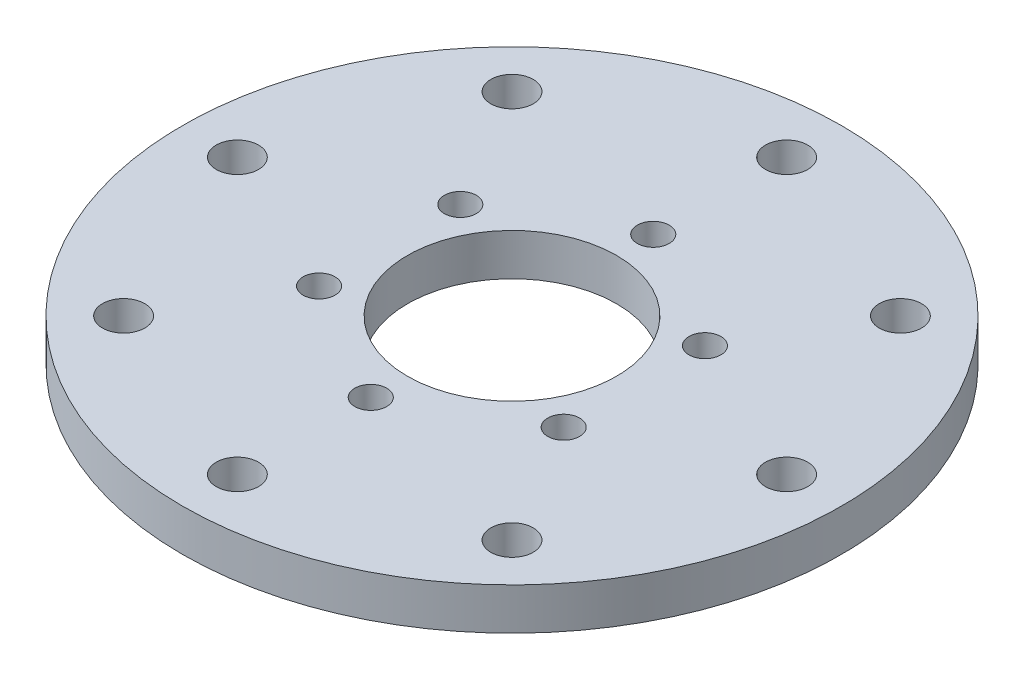
ISO-10303-21;
HEADER;
FILE_DESCRIPTION(('STEP AP214'),'2;1');
FILE_NAME('part.step','',(''),(''),'','','');
FILE_SCHEMA(('AUTOMOTIVE_DESIGN { 1 0 10303 214 1 1 1 1 }'));
ENDSEC;
DATA;
#1=APPLICATION_CONTEXT('core data for automotive mechanical design processes');
#2=APPLICATION_PROTOCOL_DEFINITION('international standard','automotive_design',2000,#1);
#3=PRODUCT_CONTEXT('',#1,'mechanical');
#4=PRODUCT('Part','Part','',(#3));
#5=PRODUCT_RELATED_PRODUCT_CATEGORY('part','',(#4));
#6=PRODUCT_DEFINITION_FORMATION('','',#4);
#7=PRODUCT_DEFINITION_CONTEXT('part definition',#1,'design');
#8=PRODUCT_DEFINITION('design','',#6,#7);
#9=PRODUCT_DEFINITION_SHAPE('','',#8);
#10=(LENGTH_UNIT() NAMED_UNIT(*) SI_UNIT(.MILLI.,.METRE.));
#11=(NAMED_UNIT(*) PLANE_ANGLE_UNIT() SI_UNIT($,.RADIAN.));
#12=(NAMED_UNIT(*) SI_UNIT($,.STERADIAN.) SOLID_ANGLE_UNIT());
#13=UNCERTAINTY_MEASURE_WITH_UNIT(LENGTH_MEASURE(1.E-05),#10,'distance_accuracy_value','');
#14=(GEOMETRIC_REPRESENTATION_CONTEXT(3) GLOBAL_UNCERTAINTY_ASSIGNED_CONTEXT((#13)) GLOBAL_UNIT_ASSIGNED_CONTEXT((#10,
#11,#12)) REPRESENTATION_CONTEXT('',''));
#15=CARTESIAN_POINT('',(0.,0.,0.));
#16=DIRECTION('',(0.,0.,1.));
#17=DIRECTION('',(1.,0.,0.));
#18=AXIS2_PLACEMENT_3D('',#15,#16,#17);
#19=CARTESIAN_POINT('',(0.,4.,0.));
#20=DIRECTION('',(0.,1.,0.));
#21=DIRECTION('',(0.,0.,1.));
#22=AXIS2_PLACEMENT_3D('',#19,#20,#21);
#23=PLANE('',#22);
#24=CARTESIAN_POINT('',(0.,4.,0.));
#25=DIRECTION('',(0.,1.,0.));
#26=DIRECTION('',(0.,0.,1.));
#27=AXIS2_PLACEMENT_3D('',#24,#25,#26);
#28=CIRCLE('',#27,10.);
#29=CARTESIAN_POINT('',(0.,4.,10.));
#30=VERTEX_POINT('',#29);
#31=EDGE_CURVE('E131',#30,#30,#28,.F.);
#32=ORIENTED_EDGE('',*,*,#31,.T.);
#33=EDGE_LOOP('',(#32));
#34=FACE_BOUND('',#33,.T.);
#35=CARTESIAN_POINT('',(0.,4.,13.5));
#36=DIRECTION('',(0.,1.,0.));
#37=DIRECTION('',(0.,0.,1.));
#38=AXIS2_PLACEMENT_3D('',#35,#36,#37);
#39=CIRCLE('',#38,1.525);
#40=CARTESIAN_POINT('',(0.,4.,15.025));
#41=VERTEX_POINT('',#40);
#42=EDGE_CURVE('E80',#41,#41,#39,.F.);
#43=ORIENTED_EDGE('',*,*,#42,.T.);
#44=EDGE_LOOP('',(#43));
#45=FACE_BOUND('',#44,.T.);
#46=CARTESIAN_POINT('',(-11.6913429510899,4.,6.75));
#47=DIRECTION('',(0.,1.,0.));
#48=DIRECTION('',(0.,0.,1.));
#49=AXIS2_PLACEMENT_3D('',#46,#47,#48);
#50=CIRCLE('',#49,1.525);
#51=CARTESIAN_POINT('',(-11.6913429510899,4.,8.275));
#52=VERTEX_POINT('',#51);
#53=EDGE_CURVE('E107',#52,#52,#50,.F.);
#54=ORIENTED_EDGE('',*,*,#53,.T.);
#55=EDGE_LOOP('',(#54));
#56=FACE_BOUND('',#55,.T.);
#57=CARTESIAN_POINT('',(-11.6913429510899,4.,-6.75000000000001));
#58=DIRECTION('',(0.,1.,0.));
#59=DIRECTION('',(0.,0.,1.));
#60=AXIS2_PLACEMENT_3D('',#57,#58,#59);
#61=CIRCLE('',#60,1.525);
#62=CARTESIAN_POINT('',(-11.6913429510899,4.,-5.225));
#63=VERTEX_POINT('',#62);
#64=EDGE_CURVE('E100',#63,#63,#61,.F.);
#65=ORIENTED_EDGE('',*,*,#64,.T.);
#66=EDGE_LOOP('',(#65));
#67=FACE_BOUND('',#66,.T.);
#68=CARTESIAN_POINT('',(0.,4.,-13.5));
#69=DIRECTION('',(0.,1.,0.));
#70=DIRECTION('',(0.,0.,1.));
#71=AXIS2_PLACEMENT_3D('',#68,#69,#70);
#72=CIRCLE('',#71,1.525);
#73=CARTESIAN_POINT('',(0.,4.,-11.975));
#74=VERTEX_POINT('',#73);
#75=EDGE_CURVE('E108',#74,#74,#72,.F.);
#76=ORIENTED_EDGE('',*,*,#75,.T.);
#77=EDGE_LOOP('',(#76));
#78=FACE_BOUND('',#77,.T.);
#79=CARTESIAN_POINT('',(11.6913429510899,4.,-6.75));
#80=DIRECTION('',(0.,1.,0.));
#81=DIRECTION('',(0.,0.,1.));
#82=AXIS2_PLACEMENT_3D('',#79,#80,#81);
#83=CIRCLE('',#82,1.525);
#84=CARTESIAN_POINT('',(11.6913429510899,4.,-5.225));
#85=VERTEX_POINT('',#84);
#86=EDGE_CURVE('E114',#85,#85,#83,.F.);
#87=ORIENTED_EDGE('',*,*,#86,.T.);
#88=EDGE_LOOP('',(#87));
#89=FACE_BOUND('',#88,.T.);
#90=CARTESIAN_POINT('',(11.6913429510899,4.,6.75));
#91=DIRECTION('',(0.,1.,0.));
#92=DIRECTION('',(0.,0.,1.));
#93=AXIS2_PLACEMENT_3D('',#90,#91,#92);
#94=CIRCLE('',#93,1.525);
#95=CARTESIAN_POINT('',(11.6913429510899,4.,8.275));
#96=VERTEX_POINT('',#95);
#97=EDGE_CURVE('E120',#96,#96,#94,.F.);
#98=ORIENTED_EDGE('',*,*,#97,.T.);
#99=EDGE_LOOP('',(#98));
#100=FACE_BOUND('',#99,.T.);
#101=CARTESIAN_POINT('',(0.,4.,-26.25));
#102=DIRECTION('',(0.,1.,0.));
#103=DIRECTION('',(0.,0.,1.));
#104=AXIS2_PLACEMENT_3D('',#101,#102,#103);
#105=CIRCLE('',#104,2.025);
#106=CARTESIAN_POINT('',(0.,4.,-24.225));
#107=VERTEX_POINT('',#106);
#108=EDGE_CURVE('E50',#107,#107,#105,.T.);
#109=ORIENTED_EDGE('',*,*,#108,.F.);
#110=EDGE_LOOP('',(#109));
#111=FACE_BOUND('',#110,.T.);
#112=CARTESIAN_POINT('',(18.5615530061469,4.,-18.5615530061469));
#113=DIRECTION('',(0.,1.,0.));
#114=DIRECTION('',(0.,0.,1.));
#115=AXIS2_PLACEMENT_3D('',#112,#113,#114);
#116=CIRCLE('',#115,2.02500000000005);
#117=CARTESIAN_POINT('',(18.5615530061469,4.,-16.5365530061468));
#118=VERTEX_POINT('',#117);
#119=EDGE_CURVE('E54',#118,#118,#116,.T.);
#120=ORIENTED_EDGE('',*,*,#119,.F.);
#121=EDGE_LOOP('',(#120));
#122=FACE_BOUND('',#121,.T.);
#123=CARTESIAN_POINT('',(26.25,4.,0.));
#124=DIRECTION('',(0.,1.,0.));
#125=DIRECTION('',(0.,0.,1.));
#126=AXIS2_PLACEMENT_3D('',#123,#124,#125);
#127=CIRCLE('',#126,2.02500000000009);
#128=CARTESIAN_POINT('',(26.25,4.,2.02500000000009));
#129=VERTEX_POINT('',#128);
#130=EDGE_CURVE('E57',#129,#129,#127,.T.);
#131=ORIENTED_EDGE('',*,*,#130,.F.);
#132=EDGE_LOOP('',(#131));
#133=FACE_BOUND('',#132,.T.);
#134=CARTESIAN_POINT('',(18.5615530061469,4.,18.5615530061469));
#135=DIRECTION('',(0.,1.,0.));
#136=DIRECTION('',(0.,0.,1.));
#137=AXIS2_PLACEMENT_3D('',#134,#135,#136);
#138=CIRCLE('',#137,2.02500000000013);
#139=CARTESIAN_POINT('',(18.5615530061469,4.,20.586553006147));
#140=VERTEX_POINT('',#139);
#141=EDGE_CURVE('E60',#140,#140,#138,.T.);
#142=ORIENTED_EDGE('',*,*,#141,.F.);
#143=EDGE_LOOP('',(#142));
#144=FACE_BOUND('',#143,.T.);
#145=CARTESIAN_POINT('',(0.,4.,26.25));
#146=DIRECTION('',(0.,1.,0.));
#147=DIRECTION('',(0.,0.,1.));
#148=AXIS2_PLACEMENT_3D('',#145,#146,#147);
#149=CIRCLE('',#148,2.02500000000018);
#150=CARTESIAN_POINT('',(0.,4.,28.2750000000002));
#151=VERTEX_POINT('',#150);
#152=EDGE_CURVE('E63',#151,#151,#149,.T.);
#153=ORIENTED_EDGE('',*,*,#152,.F.);
#154=EDGE_LOOP('',(#153));
#155=FACE_BOUND('',#154,.T.);
#156=CARTESIAN_POINT('',(-18.5615530061469,4.,18.5615530061469));
#157=DIRECTION('',(0.,1.,0.));
#158=DIRECTION('',(0.,0.,1.));
#159=AXIS2_PLACEMENT_3D('',#156,#157,#158);
#160=CIRCLE('',#159,2.02500000000022);
#161=CARTESIAN_POINT('',(-18.5615530061469,4.,20.5865530061471));
#162=VERTEX_POINT('',#161);
#163=EDGE_CURVE('E66',#162,#162,#160,.T.);
#164=ORIENTED_EDGE('',*,*,#163,.F.);
#165=EDGE_LOOP('',(#164));
#166=FACE_BOUND('',#165,.T.);
#167=CARTESIAN_POINT('',(-26.25,4.,0.));
#168=DIRECTION('',(0.,1.,0.));
#169=DIRECTION('',(0.,0.,1.));
#170=AXIS2_PLACEMENT_3D('',#167,#168,#169);
#171=CIRCLE('',#170,2.02500000000027);
#172=CARTESIAN_POINT('',(-26.25,4.,2.02500000000027));
#173=VERTEX_POINT('',#172);
#174=EDGE_CURVE('E69',#173,#173,#171,.T.);
#175=ORIENTED_EDGE('',*,*,#174,.F.);
#176=EDGE_LOOP('',(#175));
#177=FACE_BOUND('',#176,.T.);
#178=CARTESIAN_POINT('',(-18.5615530061469,4.,-18.5615530061469));
#179=DIRECTION('',(0.,1.,0.));
#180=DIRECTION('',(0.,0.,1.));
#181=AXIS2_PLACEMENT_3D('',#178,#179,#180);
#182=CIRCLE('',#181,2.02500000000031);
#183=CARTESIAN_POINT('',(-18.5615530061469,4.,-16.5365530061466));
#184=VERTEX_POINT('',#183);
#185=EDGE_CURVE('E72',#184,#184,#182,.T.);
#186=ORIENTED_EDGE('',*,*,#185,.F.);
#187=EDGE_LOOP('',(#186));
#188=FACE_BOUND('',#187,.T.);
#189=CARTESIAN_POINT('',(0.,4.,0.));
#190=DIRECTION('',(0.,1.,0.));
#191=DIRECTION('',(0.,0.,1.));
#192=AXIS2_PLACEMENT_3D('',#189,#190,#191);
#193=CIRCLE('',#192,31.5);
#194=CARTESIAN_POINT('',(0.,4.,31.5));
#195=VERTEX_POINT('',#194);
#196=EDGE_CURVE('E10',#195,#195,#193,.T.);
#197=ORIENTED_EDGE('',*,*,#196,.T.);
#198=EDGE_LOOP('',(#197));
#199=FACE_BOUND('',#198,.T.);
#200=ADVANCED_FACE('F39',(#34,#45,#56,#67,#78,#89,#100,#111,#122,#133,#144,#155,#166,#177,#188,
#199),#23,.T.);
#201=CARTESIAN_POINT('',(0.,0.,0.));
#202=DIRECTION('',(0.,1.,0.));
#203=DIRECTION('',(0.,0.,1.));
#204=AXIS2_PLACEMENT_3D('',#201,#202,#203);
#205=PLANE('',#204);
#206=CARTESIAN_POINT('',(0.,0.,0.));
#207=DIRECTION('',(0.,-1.,0.));
#208=DIRECTION('',(0.,0.,-1.));
#209=AXIS2_PLACEMENT_3D('',#206,#207,#208);
#210=CIRCLE('',#209,10.);
#211=CARTESIAN_POINT('',(0.,0.,-10.));
#212=VERTEX_POINT('',#211);
#213=EDGE_CURVE('E138',#212,#212,#210,.T.);
#214=ORIENTED_EDGE('',*,*,#213,.F.);
#215=EDGE_LOOP('',(#214));
#216=FACE_BOUND('',#215,.T.);
#217=CARTESIAN_POINT('',(0.,0.,13.5));
#218=DIRECTION('',(0.,-1.,0.));
#219=DIRECTION('',(0.,0.,-1.));
#220=AXIS2_PLACEMENT_3D('',#217,#218,#219);
#221=CIRCLE('',#220,1.525);
#222=CARTESIAN_POINT('',(0.,0.,11.975));
#223=VERTEX_POINT('',#222);
#224=EDGE_CURVE('E123',#223,#223,#221,.T.);
#225=ORIENTED_EDGE('',*,*,#224,.F.);
#226=EDGE_LOOP('',(#225));
#227=FACE_BOUND('',#226,.T.);
#228=CARTESIAN_POINT('',(-11.6913429510899,0.,6.75));
#229=DIRECTION('',(0.,-1.,0.));
#230=DIRECTION('',(0.,0.,-1.));
#231=AXIS2_PLACEMENT_3D('',#228,#229,#230);
#232=CIRCLE('',#231,1.525);
#233=CARTESIAN_POINT('',(-11.6913429510899,0.,5.225));
#234=VERTEX_POINT('',#233);
#235=EDGE_CURVE('E128',#234,#234,#232,.T.);
#236=ORIENTED_EDGE('',*,*,#235,.F.);
#237=EDGE_LOOP('',(#236));
#238=FACE_BOUND('',#237,.T.);
#239=CARTESIAN_POINT('',(-11.6913429510899,0.,-6.75000000000001));
#240=DIRECTION('',(0.,-1.,0.));
#241=DIRECTION('',(0.,0.,-1.));
#242=AXIS2_PLACEMENT_3D('',#239,#240,#241);
#243=CIRCLE('',#242,1.525);
#244=CARTESIAN_POINT('',(-11.6913429510899,0.,-8.27500000000001));
#245=VERTEX_POINT('',#244);
#246=EDGE_CURVE('E104',#245,#245,#243,.T.);
#247=ORIENTED_EDGE('',*,*,#246,.F.);
#248=EDGE_LOOP('',(#247));
#249=FACE_BOUND('',#248,.T.);
#250=CARTESIAN_POINT('',(0.,0.,-13.5));
#251=DIRECTION('',(0.,-1.,0.));
#252=DIRECTION('',(0.,0.,-1.));
#253=AXIS2_PLACEMENT_3D('',#250,#251,#252);
#254=CIRCLE('',#253,1.525);
#255=CARTESIAN_POINT('',(0.,0.,-15.025));
#256=VERTEX_POINT('',#255);
#257=EDGE_CURVE('E103',#256,#256,#254,.T.);
#258=ORIENTED_EDGE('',*,*,#257,.F.);
#259=EDGE_LOOP('',(#258));
#260=FACE_BOUND('',#259,.T.);
#261=CARTESIAN_POINT('',(11.6913429510899,0.,-6.75));
#262=DIRECTION('',(0.,-1.,0.));
#263=DIRECTION('',(0.,0.,-1.));
#264=AXIS2_PLACEMENT_3D('',#261,#262,#263);
#265=CIRCLE('',#264,1.525);
#266=CARTESIAN_POINT('',(11.6913429510899,0.,-8.275));
#267=VERTEX_POINT('',#266);
#268=EDGE_CURVE('E111',#267,#267,#265,.T.);
#269=ORIENTED_EDGE('',*,*,#268,.F.);
#270=EDGE_LOOP('',(#269));
#271=FACE_BOUND('',#270,.T.);
#272=CARTESIAN_POINT('',(11.6913429510899,0.,6.75));
#273=DIRECTION('',(0.,-1.,0.));
#274=DIRECTION('',(0.,0.,-1.));
#275=AXIS2_PLACEMENT_3D('',#272,#273,#274);
#276=CIRCLE('',#275,1.525);
#277=CARTESIAN_POINT('',(11.6913429510899,0.,5.225));
#278=VERTEX_POINT('',#277);
#279=EDGE_CURVE('E117',#278,#278,#276,.T.);
#280=ORIENTED_EDGE('',*,*,#279,.F.);
#281=EDGE_LOOP('',(#280));
#282=FACE_BOUND('',#281,.T.);
#283=CARTESIAN_POINT('',(0.,0.,-26.25));
#284=DIRECTION('',(0.,1.,0.));
#285=DIRECTION('',(0.,0.,1.));
#286=AXIS2_PLACEMENT_3D('',#283,#284,#285);
#287=CIRCLE('',#286,2.025);
#288=CARTESIAN_POINT('',(0.,0.,-24.225));
#289=VERTEX_POINT('',#288);
#290=EDGE_CURVE('E75',#289,#289,#287,.T.);
#291=ORIENTED_EDGE('',*,*,#290,.T.);
#292=EDGE_LOOP('',(#291));
#293=FACE_BOUND('',#292,.T.);
#294=CARTESIAN_POINT('',(18.5615530061469,0.,-18.5615530061469));
#295=DIRECTION('',(0.,1.,0.));
#296=DIRECTION('',(0.,0.,1.));
#297=AXIS2_PLACEMENT_3D('',#294,#295,#296);
#298=CIRCLE('',#297,2.02500000000005);
#299=CARTESIAN_POINT('',(18.5615530061469,0.,-16.5365530061468));
#300=VERTEX_POINT('',#299);
#301=EDGE_CURVE('E95',#300,#300,#298,.T.);
#302=ORIENTED_EDGE('',*,*,#301,.T.);
#303=EDGE_LOOP('',(#302));
#304=FACE_BOUND('',#303,.T.);
#305=CARTESIAN_POINT('',(26.25,0.,0.));
#306=DIRECTION('',(0.,1.,0.));
#307=DIRECTION('',(0.,0.,1.));
#308=AXIS2_PLACEMENT_3D('',#305,#306,#307);
#309=CIRCLE('',#308,2.02500000000009);
#310=CARTESIAN_POINT('',(26.25,0.,2.02500000000009));
#311=VERTEX_POINT('',#310);
#312=EDGE_CURVE('E92',#311,#311,#309,.T.);
#313=ORIENTED_EDGE('',*,*,#312,.T.);
#314=EDGE_LOOP('',(#313));
#315=FACE_BOUND('',#314,.T.);
#316=CARTESIAN_POINT('',(18.5615530061469,0.,18.5615530061469));
#317=DIRECTION('',(0.,1.,0.));
#318=DIRECTION('',(0.,0.,1.));
#319=AXIS2_PLACEMENT_3D('',#316,#317,#318);
#320=CIRCLE('',#319,2.02500000000013);
#321=CARTESIAN_POINT('',(18.5615530061469,0.,20.586553006147));
#322=VERTEX_POINT('',#321);
#323=EDGE_CURVE('E89',#322,#322,#320,.T.);
#324=ORIENTED_EDGE('',*,*,#323,.T.);
#325=EDGE_LOOP('',(#324));
#326=FACE_BOUND('',#325,.T.);
#327=CARTESIAN_POINT('',(0.,0.,26.25));
#328=DIRECTION('',(0.,1.,0.));
#329=DIRECTION('',(0.,0.,1.));
#330=AXIS2_PLACEMENT_3D('',#327,#328,#329);
#331=CIRCLE('',#330,2.02500000000018);
#332=CARTESIAN_POINT('',(0.,0.,28.2750000000002));
#333=VERTEX_POINT('',#332);
#334=EDGE_CURVE('E86',#333,#333,#331,.T.);
#335=ORIENTED_EDGE('',*,*,#334,.T.);
#336=EDGE_LOOP('',(#335));
#337=FACE_BOUND('',#336,.T.);
#338=CARTESIAN_POINT('',(-18.5615530061469,0.,18.5615530061469));
#339=DIRECTION('',(0.,1.,0.));
#340=DIRECTION('',(0.,0.,1.));
#341=AXIS2_PLACEMENT_3D('',#338,#339,#340);
#342=CIRCLE('',#341,2.02500000000022);
#343=CARTESIAN_POINT('',(-18.5615530061469,0.,20.5865530061471));
#344=VERTEX_POINT('',#343);
#345=EDGE_CURVE('E83',#344,#344,#342,.T.);
#346=ORIENTED_EDGE('',*,*,#345,.T.);
#347=EDGE_LOOP('',(#346));
#348=FACE_BOUND('',#347,.T.);
#349=CARTESIAN_POINT('',(-26.25,0.,0.));
#350=DIRECTION('',(0.,1.,0.));
#351=DIRECTION('',(0.,0.,1.));
#352=AXIS2_PLACEMENT_3D('',#349,#350,#351);
#353=CIRCLE('',#352,2.02500000000027);
#354=CARTESIAN_POINT('',(-26.25,0.,2.02500000000027));
#355=VERTEX_POINT('',#354);
#356=EDGE_CURVE('E79',#355,#355,#353,.T.);
#357=ORIENTED_EDGE('',*,*,#356,.T.);
#358=EDGE_LOOP('',(#357));
#359=FACE_BOUND('',#358,.T.);
#360=CARTESIAN_POINT('',(-18.5615530061469,0.,-18.5615530061469));
#361=DIRECTION('',(0.,1.,0.));
#362=DIRECTION('',(0.,0.,1.));
#363=AXIS2_PLACEMENT_3D('',#360,#361,#362);
#364=CIRCLE('',#363,2.02500000000031);
#365=CARTESIAN_POINT('',(-18.5615530061469,0.,-16.5365530061466));
#366=VERTEX_POINT('',#365);
#367=EDGE_CURVE('E76',#366,#366,#364,.T.);
#368=ORIENTED_EDGE('',*,*,#367,.T.);
#369=EDGE_LOOP('',(#368));
#370=FACE_BOUND('',#369,.T.);
#371=CARTESIAN_POINT('',(0.,0.,0.));
#372=DIRECTION('',(0.,1.,0.));
#373=DIRECTION('',(0.,0.,1.));
#374=AXIS2_PLACEMENT_3D('',#371,#372,#373);
#375=CIRCLE('',#374,31.5);
#376=CARTESIAN_POINT('',(0.,0.,31.5));
#377=VERTEX_POINT('',#376);
#378=EDGE_CURVE('E43',#377,#377,#375,.T.);
#379=ORIENTED_EDGE('',*,*,#378,.F.);
#380=EDGE_LOOP('',(#379));
#381=FACE_BOUND('',#380,.T.);
#382=ADVANCED_FACE('F145',(#216,#227,#238,#249,#260,#271,#282,#293,#304,#315,#326,#337,#348,
#359,#370,#381),#205,.F.);
#383=CARTESIAN_POINT('',(0.,4.,0.));
#384=DIRECTION('',(0.,-1.,0.));
#385=DIRECTION('',(0.,0.,-1.));
#386=AXIS2_PLACEMENT_3D('',#383,#384,#385);
#387=CYLINDRICAL_SURFACE('',#386,31.5);
#388=ORIENTED_EDGE('',*,*,#196,.F.);
#389=EDGE_LOOP('',(#388));
#390=FACE_BOUND('',#389,.T.);
#391=ORIENTED_EDGE('',*,*,#378,.T.);
#392=EDGE_LOOP('',(#391));
#393=FACE_BOUND('',#392,.T.);
#394=ADVANCED_FACE('F41',(#390,#393),#387,.T.);
#395=CARTESIAN_POINT('',(-18.5615530061469,0.,-18.5615530061469));
#396=DIRECTION('',(0.,1.,0.));
#397=DIRECTION('',(0.,0.,1.));
#398=AXIS2_PLACEMENT_3D('',#395,#396,#397);
#399=CYLINDRICAL_SURFACE('',#398,2.02500000000031);
#400=ORIENTED_EDGE('',*,*,#185,.T.);
#401=EDGE_LOOP('',(#400));
#402=FACE_BOUND('',#401,.T.);
#403=ORIENTED_EDGE('',*,*,#367,.F.);
#404=EDGE_LOOP('',(#403));
#405=FACE_BOUND('',#404,.T.);
#406=ADVANCED_FACE('F179',(#402,#405),#399,.F.);
#407=CARTESIAN_POINT('',(-26.25,0.,0.));
#408=DIRECTION('',(0.,1.,0.));
#409=DIRECTION('',(0.,0.,1.));
#410=AXIS2_PLACEMENT_3D('',#407,#408,#409);
#411=CYLINDRICAL_SURFACE('',#410,2.02500000000027);
#412=ORIENTED_EDGE('',*,*,#174,.T.);
#413=EDGE_LOOP('',(#412));
#414=FACE_BOUND('',#413,.T.);
#415=ORIENTED_EDGE('',*,*,#356,.F.);
#416=EDGE_LOOP('',(#415));
#417=FACE_BOUND('',#416,.T.);
#418=ADVANCED_FACE('F184',(#414,#417),#411,.F.);
#419=CARTESIAN_POINT('',(-18.5615530061469,0.,18.5615530061469));
#420=DIRECTION('',(0.,1.,0.));
#421=DIRECTION('',(0.,0.,1.));
#422=AXIS2_PLACEMENT_3D('',#419,#420,#421);
#423=CYLINDRICAL_SURFACE('',#422,2.02500000000022);
#424=ORIENTED_EDGE('',*,*,#163,.T.);
#425=EDGE_LOOP('',(#424));
#426=FACE_BOUND('',#425,.T.);
#427=ORIENTED_EDGE('',*,*,#345,.F.);
#428=EDGE_LOOP('',(#427));
#429=FACE_BOUND('',#428,.T.);
#430=ADVANCED_FACE('F196',(#426,#429),#423,.F.);
#431=CARTESIAN_POINT('',(0.,0.,26.25));
#432=DIRECTION('',(0.,1.,0.));
#433=DIRECTION('',(0.,0.,1.));
#434=AXIS2_PLACEMENT_3D('',#431,#432,#433);
#435=CYLINDRICAL_SURFACE('',#434,2.02500000000018);
#436=ORIENTED_EDGE('',*,*,#152,.T.);
#437=EDGE_LOOP('',(#436));
#438=FACE_BOUND('',#437,.T.);
#439=ORIENTED_EDGE('',*,*,#334,.F.);
#440=EDGE_LOOP('',(#439));
#441=FACE_BOUND('',#440,.T.);
#442=ADVANCED_FACE('F200',(#438,#441),#435,.F.);
#443=CARTESIAN_POINT('',(18.5615530061469,0.,18.5615530061469));
#444=DIRECTION('',(0.,1.,0.));
#445=DIRECTION('',(0.,0.,1.));
#446=AXIS2_PLACEMENT_3D('',#443,#444,#445);
#447=CYLINDRICAL_SURFACE('',#446,2.02500000000013);
#448=ORIENTED_EDGE('',*,*,#141,.T.);
#449=EDGE_LOOP('',(#448));
#450=FACE_BOUND('',#449,.T.);
#451=ORIENTED_EDGE('',*,*,#323,.F.);
#452=EDGE_LOOP('',(#451));
#453=FACE_BOUND('',#452,.T.);
#454=ADVANCED_FACE('F204',(#450,#453),#447,.F.);
#455=CARTESIAN_POINT('',(26.25,0.,0.));
#456=DIRECTION('',(0.,1.,0.));
#457=DIRECTION('',(0.,0.,1.));
#458=AXIS2_PLACEMENT_3D('',#455,#456,#457);
#459=CYLINDRICAL_SURFACE('',#458,2.02500000000009);
#460=ORIENTED_EDGE('',*,*,#130,.T.);
#461=EDGE_LOOP('',(#460));
#462=FACE_BOUND('',#461,.T.);
#463=ORIENTED_EDGE('',*,*,#312,.F.);
#464=EDGE_LOOP('',(#463));
#465=FACE_BOUND('',#464,.T.);
#466=ADVANCED_FACE('F208',(#462,#465),#459,.F.);
#467=CARTESIAN_POINT('',(18.5615530061469,0.,-18.5615530061469));
#468=DIRECTION('',(0.,1.,0.));
#469=DIRECTION('',(0.,0.,1.));
#470=AXIS2_PLACEMENT_3D('',#467,#468,#469);
#471=CYLINDRICAL_SURFACE('',#470,2.02500000000005);
#472=ORIENTED_EDGE('',*,*,#119,.T.);
#473=EDGE_LOOP('',(#472));
#474=FACE_BOUND('',#473,.T.);
#475=ORIENTED_EDGE('',*,*,#301,.F.);
#476=EDGE_LOOP('',(#475));
#477=FACE_BOUND('',#476,.T.);
#478=ADVANCED_FACE('F212',(#474,#477),#471,.F.);
#479=CARTESIAN_POINT('',(0.,0.,-26.25));
#480=DIRECTION('',(0.,1.,0.));
#481=DIRECTION('',(0.,0.,1.));
#482=AXIS2_PLACEMENT_3D('',#479,#480,#481);
#483=CYLINDRICAL_SURFACE('',#482,2.025);
#484=ORIENTED_EDGE('',*,*,#108,.T.);
#485=EDGE_LOOP('',(#484));
#486=FACE_BOUND('',#485,.T.);
#487=ORIENTED_EDGE('',*,*,#290,.F.);
#488=EDGE_LOOP('',(#487));
#489=FACE_BOUND('',#488,.T.);
#490=ADVANCED_FACE('F216',(#486,#489),#483,.F.);
#491=CARTESIAN_POINT('',(11.6913429510899,8.31335136523794,6.75));
#492=DIRECTION('',(0.,-1.,0.));
#493=DIRECTION('',(0.,0.,-1.));
#494=AXIS2_PLACEMENT_3D('',#491,#492,#493);
#495=CYLINDRICAL_SURFACE('',#494,1.525);
#496=ORIENTED_EDGE('',*,*,#279,.T.);
#497=EDGE_LOOP('',(#496));
#498=FACE_BOUND('',#497,.T.);
#499=ORIENTED_EDGE('',*,*,#97,.F.);
#500=EDGE_LOOP('',(#499));
#501=FACE_BOUND('',#500,.T.);
#502=ADVANCED_FACE('F220',(#498,#501),#495,.F.);
#503=CARTESIAN_POINT('',(11.6913429510899,8.31335136523794,-6.75));
#504=DIRECTION('',(0.,-1.,0.));
#505=DIRECTION('',(0.,0.,-1.));
#506=AXIS2_PLACEMENT_3D('',#503,#504,#505);
#507=CYLINDRICAL_SURFACE('',#506,1.525);
#508=ORIENTED_EDGE('',*,*,#268,.T.);
#509=EDGE_LOOP('',(#508));
#510=FACE_BOUND('',#509,.T.);
#511=ORIENTED_EDGE('',*,*,#86,.F.);
#512=EDGE_LOOP('',(#511));
#513=FACE_BOUND('',#512,.T.);
#514=ADVANCED_FACE('F230',(#510,#513),#507,.F.);
#515=CARTESIAN_POINT('',(0.,8.31335136523794,-13.5));
#516=DIRECTION('',(0.,-1.,0.));
#517=DIRECTION('',(0.,0.,-1.));
#518=AXIS2_PLACEMENT_3D('',#515,#516,#517);
#519=CYLINDRICAL_SURFACE('',#518,1.525);
#520=ORIENTED_EDGE('',*,*,#257,.T.);
#521=EDGE_LOOP('',(#520));
#522=FACE_BOUND('',#521,.T.);
#523=ORIENTED_EDGE('',*,*,#75,.F.);
#524=EDGE_LOOP('',(#523));
#525=FACE_BOUND('',#524,.T.);
#526=ADVANCED_FACE('F226',(#522,#525),#519,.F.);
#527=CARTESIAN_POINT('',(-11.6913429510899,8.31335136523794,-6.75000000000001));
#528=DIRECTION('',(0.,-1.,0.));
#529=DIRECTION('',(0.,0.,-1.));
#530=AXIS2_PLACEMENT_3D('',#527,#528,#529);
#531=CYLINDRICAL_SURFACE('',#530,1.525);
#532=ORIENTED_EDGE('',*,*,#246,.T.);
#533=EDGE_LOOP('',(#532));
#534=FACE_BOUND('',#533,.T.);
#535=ORIENTED_EDGE('',*,*,#64,.F.);
#536=EDGE_LOOP('',(#535));
#537=FACE_BOUND('',#536,.T.);
#538=ADVANCED_FACE('F222',(#534,#537),#531,.F.);
#539=CARTESIAN_POINT('',(-11.6913429510899,8.31335136523794,6.75));
#540=DIRECTION('',(0.,-1.,0.));
#541=DIRECTION('',(0.,0.,-1.));
#542=AXIS2_PLACEMENT_3D('',#539,#540,#541);
#543=CYLINDRICAL_SURFACE('',#542,1.525);
#544=ORIENTED_EDGE('',*,*,#235,.T.);
#545=EDGE_LOOP('',(#544));
#546=FACE_BOUND('',#545,.T.);
#547=ORIENTED_EDGE('',*,*,#53,.F.);
#548=EDGE_LOOP('',(#547));
#549=FACE_BOUND('',#548,.T.);
#550=ADVANCED_FACE('F225',(#546,#549),#543,.F.);
#551=CARTESIAN_POINT('',(0.,8.31335136523794,13.5));
#552=DIRECTION('',(0.,-1.,0.));
#553=DIRECTION('',(0.,0.,-1.));
#554=AXIS2_PLACEMENT_3D('',#551,#552,#553);
#555=CYLINDRICAL_SURFACE('',#554,1.525);
#556=ORIENTED_EDGE('',*,*,#224,.T.);
#557=EDGE_LOOP('',(#556));
#558=FACE_BOUND('',#557,.T.);
#559=ORIENTED_EDGE('',*,*,#42,.F.);
#560=EDGE_LOOP('',(#559));
#561=FACE_BOUND('',#560,.T.);
#562=ADVANCED_FACE('F240',(#558,#561),#555,.F.);
#563=CARTESIAN_POINT('',(0.,32.2842712474619,0.));
#564=DIRECTION('',(0.,-1.,0.));
#565=DIRECTION('',(0.,0.,-1.));
#566=AXIS2_PLACEMENT_3D('',#563,#564,#565);
#567=CYLINDRICAL_SURFACE('',#566,10.);
#568=ORIENTED_EDGE('',*,*,#213,.T.);
#569=EDGE_LOOP('',(#568));
#570=FACE_BOUND('',#569,.T.);
#571=ORIENTED_EDGE('',*,*,#31,.F.);
#572=EDGE_LOOP('',(#571));
#573=FACE_BOUND('',#572,.T.);
#574=ADVANCED_FACE('F142',(#570,#573),#567,.F.);
#575=CLOSED_SHELL('',(#200,#382,#394,#406,#418,#430,#442,#454,#466,#478,#490,#502,#514,#526,
#538,#550,#562,#574));
#576=MANIFOLD_SOLID_BREP('B2',#575);
#577=ADVANCED_BREP_SHAPE_REPRESENTATION('',(#18,#576),#14);
#578=SHAPE_DEFINITION_REPRESENTATION(#9,#577);
ENDSEC;
END-ISO-10303-21;
